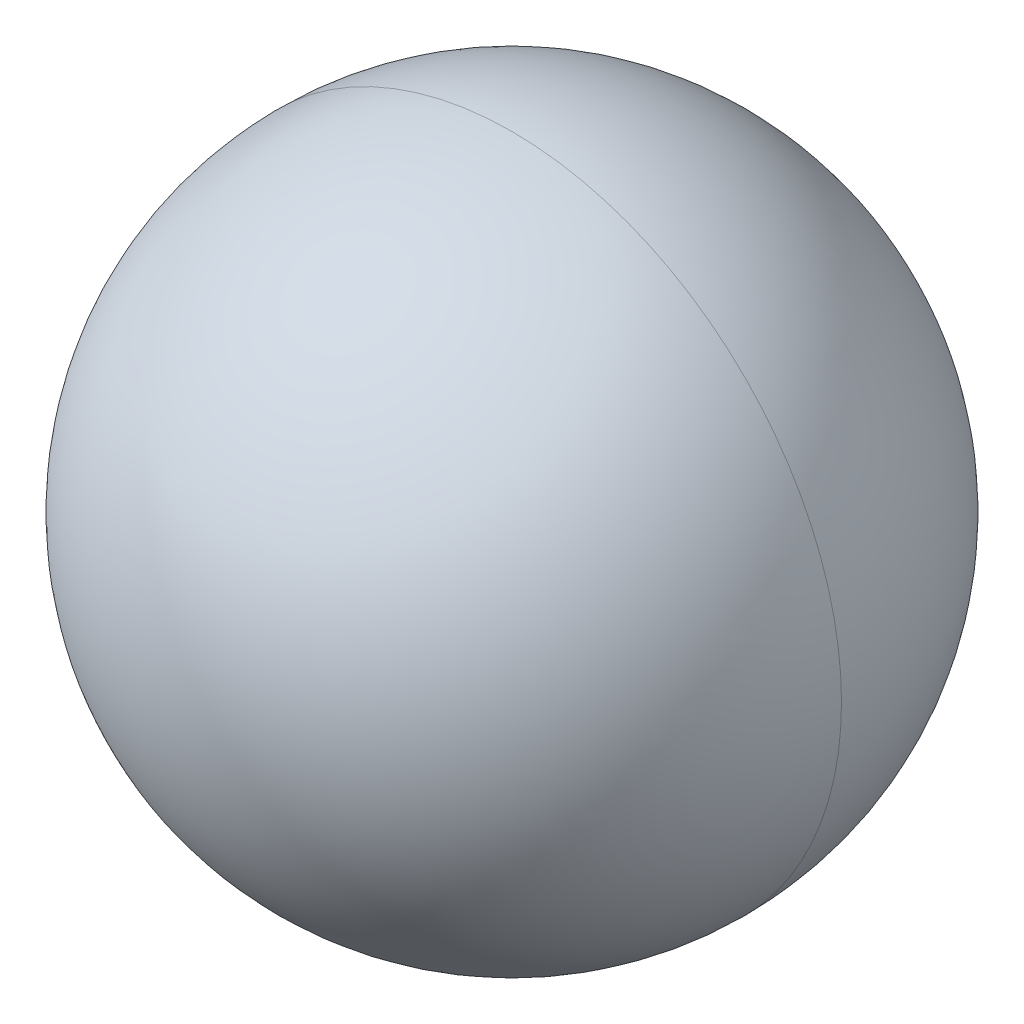
ISO-10303-21;
HEADER;
FILE_DESCRIPTION(('STEP AP214'),'2;1');
FILE_NAME('part.step','',(''),(''),'','','');
FILE_SCHEMA(('AUTOMOTIVE_DESIGN { 1 0 10303 214 1 1 1 1 }'));
ENDSEC;
DATA;
#1=APPLICATION_CONTEXT('core data for automotive mechanical design processes');
#2=APPLICATION_PROTOCOL_DEFINITION('international standard','automotive_design',2000,#1);
#3=PRODUCT_CONTEXT('',#1,'mechanical');
#4=PRODUCT('Part','Part','',(#3));
#5=PRODUCT_RELATED_PRODUCT_CATEGORY('part','',(#4));
#6=PRODUCT_DEFINITION_FORMATION('','',#4);
#7=PRODUCT_DEFINITION_CONTEXT('part definition',#1,'design');
#8=PRODUCT_DEFINITION('design','',#6,#7);
#9=PRODUCT_DEFINITION_SHAPE('','',#8);
#10=(LENGTH_UNIT() NAMED_UNIT(*) SI_UNIT(.MILLI.,.METRE.));
#11=(NAMED_UNIT(*) PLANE_ANGLE_UNIT() SI_UNIT($,.RADIAN.));
#12=(NAMED_UNIT(*) SI_UNIT($,.STERADIAN.) SOLID_ANGLE_UNIT());
#13=UNCERTAINTY_MEASURE_WITH_UNIT(LENGTH_MEASURE(1.E-05),#10,'distance_accuracy_value','');
#14=(GEOMETRIC_REPRESENTATION_CONTEXT(3) GLOBAL_UNCERTAINTY_ASSIGNED_CONTEXT((#13)) GLOBAL_UNIT_ASSIGNED_CONTEXT((#10,
#11,#12)) REPRESENTATION_CONTEXT('',''));
#15=CARTESIAN_POINT('',(0.,0.,0.));
#16=DIRECTION('',(0.,0.,1.));
#17=DIRECTION('',(1.,0.,0.));
#18=AXIS2_PLACEMENT_3D('',#15,#16,#17);
#19=CARTESIAN_POINT('',(0.,0.,0.));
#20=DIRECTION('',(0.,0.,-1.));
#21=DIRECTION('',(1.,0.,0.));
#22=AXIS2_PLACEMENT_3D('',#19,#20,#21);
#23=SPHERICAL_SURFACE('',#22,0.5);
#24=CARTESIAN_POINT('',(0.,0.,0.));
#25=DIRECTION('',(0.,0.,-1.));
#26=DIRECTION('',(-1.,0.,0.));
#27=AXIS2_PLACEMENT_3D('',#24,#25,#26);
#28=CIRCLE('',#27,0.5);
#29=CARTESIAN_POINT('',(0.,-0.5,0.));
#30=VERTEX_POINT('',#29);
#31=CARTESIAN_POINT('',(0.,0.5,0.));
#32=VERTEX_POINT('',#31);
#33=EDGE_CURVE('E11',#30,#32,#28,.T.);
#34=ORIENTED_EDGE('',*,*,#33,.F.);
#35=CARTESIAN_POINT('',(0.,0.,0.));
#36=DIRECTION('',(0.,0.,1.));
#37=DIRECTION('',(1.,0.,0.));
#38=AXIS2_PLACEMENT_3D('',#35,#36,#37);
#39=CIRCLE('',#38,0.5);
#40=EDGE_CURVE('E21',#30,#32,#39,.T.);
#41=ORIENTED_EDGE('',*,*,#40,.T.);
#42=EDGE_LOOP('',(#34,#41));
#43=FACE_BOUND('',#42,.T.);
#44=ADVANCED_FACE('F17',(#43),#23,.T.);
#45=CARTESIAN_POINT('',(0.,0.,0.));
#46=DIRECTION('',(0.,0.,-1.));
#47=DIRECTION('',(1.,0.,0.));
#48=AXIS2_PLACEMENT_3D('',#45,#46,#47);
#49=SPHERICAL_SURFACE('',#48,0.5);
#50=ORIENTED_EDGE('',*,*,#40,.F.);
#51=ORIENTED_EDGE('',*,*,#33,.T.);
#52=EDGE_LOOP('',(#50,#51));
#53=FACE_BOUND('',#52,.T.);
#54=ADVANCED_FACE('F19',(#53),#49,.T.);
#55=CLOSED_SHELL('',(#44,#54));
#56=MANIFOLD_SOLID_BREP('B1',#55);
#57=ADVANCED_BREP_SHAPE_REPRESENTATION('',(#18,#56),#14);
#58=SHAPE_DEFINITION_REPRESENTATION(#9,#57);
ENDSEC;
END-ISO-10303-21;
